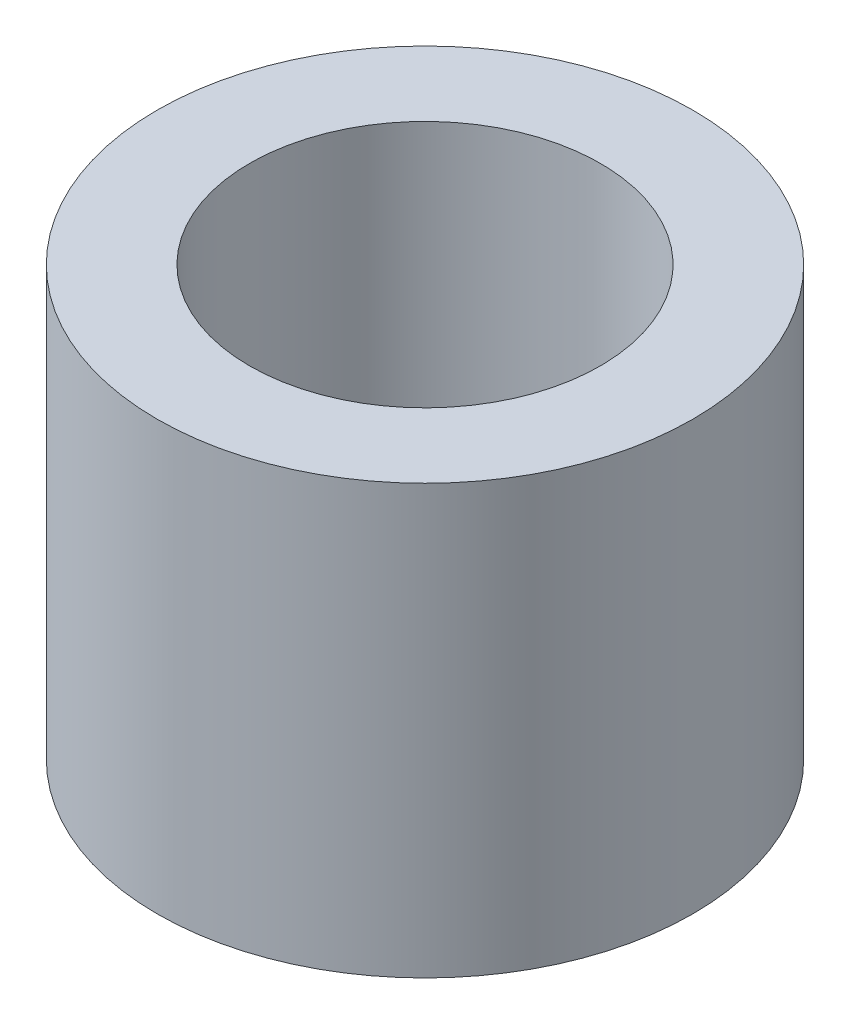
ISO-10303-21;
HEADER;
FILE_DESCRIPTION(('STEP AP214'),'2;1');
FILE_NAME('part.step','',(''),(''),'','','');
FILE_SCHEMA(('AUTOMOTIVE_DESIGN { 1 0 10303 214 1 1 1 1 }'));
ENDSEC;
DATA;
#1=APPLICATION_CONTEXT('core data for automotive mechanical design processes');
#2=APPLICATION_PROTOCOL_DEFINITION('international standard','automotive_design',2000,#1);
#3=PRODUCT_CONTEXT('',#1,'mechanical');
#4=PRODUCT('Part','Part','',(#3));
#5=PRODUCT_RELATED_PRODUCT_CATEGORY('part','',(#4));
#6=PRODUCT_DEFINITION_FORMATION('','',#4);
#7=PRODUCT_DEFINITION_CONTEXT('part definition',#1,'design');
#8=PRODUCT_DEFINITION('design','',#6,#7);
#9=PRODUCT_DEFINITION_SHAPE('','',#8);
#10=(LENGTH_UNIT() NAMED_UNIT(*) SI_UNIT(.MILLI.,.METRE.));
#11=(NAMED_UNIT(*) PLANE_ANGLE_UNIT() SI_UNIT($,.RADIAN.));
#12=(NAMED_UNIT(*) SI_UNIT($,.STERADIAN.) SOLID_ANGLE_UNIT());
#13=UNCERTAINTY_MEASURE_WITH_UNIT(LENGTH_MEASURE(1.E-05),#10,'distance_accuracy_value','');
#14=(GEOMETRIC_REPRESENTATION_CONTEXT(3) GLOBAL_UNCERTAINTY_ASSIGNED_CONTEXT((#13)) GLOBAL_UNIT_ASSIGNED_CONTEXT((#10,
#11,#12)) REPRESENTATION_CONTEXT('',''));
#15=CARTESIAN_POINT('',(0.,0.,0.));
#16=DIRECTION('',(0.,0.,1.));
#17=DIRECTION('',(1.,0.,0.));
#18=AXIS2_PLACEMENT_3D('',#15,#16,#17);
#19=CARTESIAN_POINT('',(0.,6.35,0.));
#20=DIRECTION('',(0.,1.,0.));
#21=DIRECTION('',(0.,0.,1.));
#22=AXIS2_PLACEMENT_3D('',#19,#20,#21);
#23=PLANE('',#22);
#24=CARTESIAN_POINT('',(0.,6.35,0.));
#25=DIRECTION('',(0.,1.,0.));
#26=DIRECTION('',(0.,0.,1.));
#27=AXIS2_PLACEMENT_3D('',#24,#25,#26);
#28=CIRCLE('',#27,3.96875);
#29=CARTESIAN_POINT('',(0.,6.35,3.96875));
#30=VERTEX_POINT('',#29);
#31=EDGE_CURVE('E10',#30,#30,#28,.T.);
#32=ORIENTED_EDGE('',*,*,#31,.T.);
#33=EDGE_LOOP('',(#32));
#34=FACE_BOUND('',#33,.T.);
#35=CARTESIAN_POINT('',(0.,6.35,0.));
#36=DIRECTION('',(0.,1.,0.));
#37=DIRECTION('',(0.,0.,1.));
#38=AXIS2_PLACEMENT_3D('',#35,#36,#37);
#39=CIRCLE('',#38,2.6);
#40=CARTESIAN_POINT('',(0.,6.35,2.6));
#41=VERTEX_POINT('',#40);
#42=EDGE_CURVE('E43',#41,#41,#39,.T.);
#43=ORIENTED_EDGE('',*,*,#42,.F.);
#44=EDGE_LOOP('',(#43));
#45=FACE_BOUND('',#44,.T.);
#46=ADVANCED_FACE('F32',(#34,#45),#23,.T.);
#47=CARTESIAN_POINT('',(0.,0.,0.));
#48=DIRECTION('',(0.,1.,0.));
#49=DIRECTION('',(0.,0.,1.));
#50=AXIS2_PLACEMENT_3D('',#47,#48,#49);
#51=PLANE('',#50);
#52=CARTESIAN_POINT('',(0.,0.,0.));
#53=DIRECTION('',(0.,1.,0.));
#54=DIRECTION('',(0.,0.,1.));
#55=AXIS2_PLACEMENT_3D('',#52,#53,#54);
#56=CIRCLE('',#55,3.96875);
#57=CARTESIAN_POINT('',(0.,0.,3.96875));
#58=VERTEX_POINT('',#57);
#59=EDGE_CURVE('E36',#58,#58,#56,.T.);
#60=ORIENTED_EDGE('',*,*,#59,.F.);
#61=EDGE_LOOP('',(#60));
#62=FACE_BOUND('',#61,.T.);
#63=CARTESIAN_POINT('',(0.,0.,0.));
#64=DIRECTION('',(0.,1.,0.));
#65=DIRECTION('',(0.,0.,1.));
#66=AXIS2_PLACEMENT_3D('',#63,#64,#65);
#67=CIRCLE('',#66,2.6);
#68=CARTESIAN_POINT('',(0.,0.,2.6));
#69=VERTEX_POINT('',#68);
#70=EDGE_CURVE('E45',#69,#69,#67,.T.);
#71=ORIENTED_EDGE('',*,*,#70,.T.);
#72=EDGE_LOOP('',(#71));
#73=FACE_BOUND('',#72,.T.);
#74=ADVANCED_FACE('F55',(#62,#73),#51,.F.);
#75=CARTESIAN_POINT('',(0.,6.35,0.));
#76=DIRECTION('',(0.,-1.,0.));
#77=DIRECTION('',(0.,0.,-1.));
#78=AXIS2_PLACEMENT_3D('',#75,#76,#77);
#79=CYLINDRICAL_SURFACE('',#78,3.96875);
#80=ORIENTED_EDGE('',*,*,#31,.F.);
#81=EDGE_LOOP('',(#80));
#82=FACE_BOUND('',#81,.T.);
#83=ORIENTED_EDGE('',*,*,#59,.T.);
#84=EDGE_LOOP('',(#83));
#85=FACE_BOUND('',#84,.T.);
#86=ADVANCED_FACE('F34',(#82,#85),#79,.T.);
#87=CARTESIAN_POINT('',(0.,6.35,0.));
#88=DIRECTION('',(0.,-1.,0.));
#89=DIRECTION('',(0.,0.,-1.));
#90=AXIS2_PLACEMENT_3D('',#87,#88,#89);
#91=CYLINDRICAL_SURFACE('',#90,2.6);
#92=ORIENTED_EDGE('',*,*,#42,.T.);
#93=EDGE_LOOP('',(#92));
#94=FACE_BOUND('',#93,.T.);
#95=ORIENTED_EDGE('',*,*,#70,.F.);
#96=EDGE_LOOP('',(#95));
#97=FACE_BOUND('',#96,.T.);
#98=ADVANCED_FACE('F51',(#94,#97),#91,.F.);
#99=CLOSED_SHELL('',(#46,#74,#86,#98));
#100=MANIFOLD_SOLID_BREP('B2',#99);
#101=ADVANCED_BREP_SHAPE_REPRESENTATION('',(#18,#100),#14);
#102=SHAPE_DEFINITION_REPRESENTATION(#9,#101);
ENDSEC;
END-ISO-10303-21;
